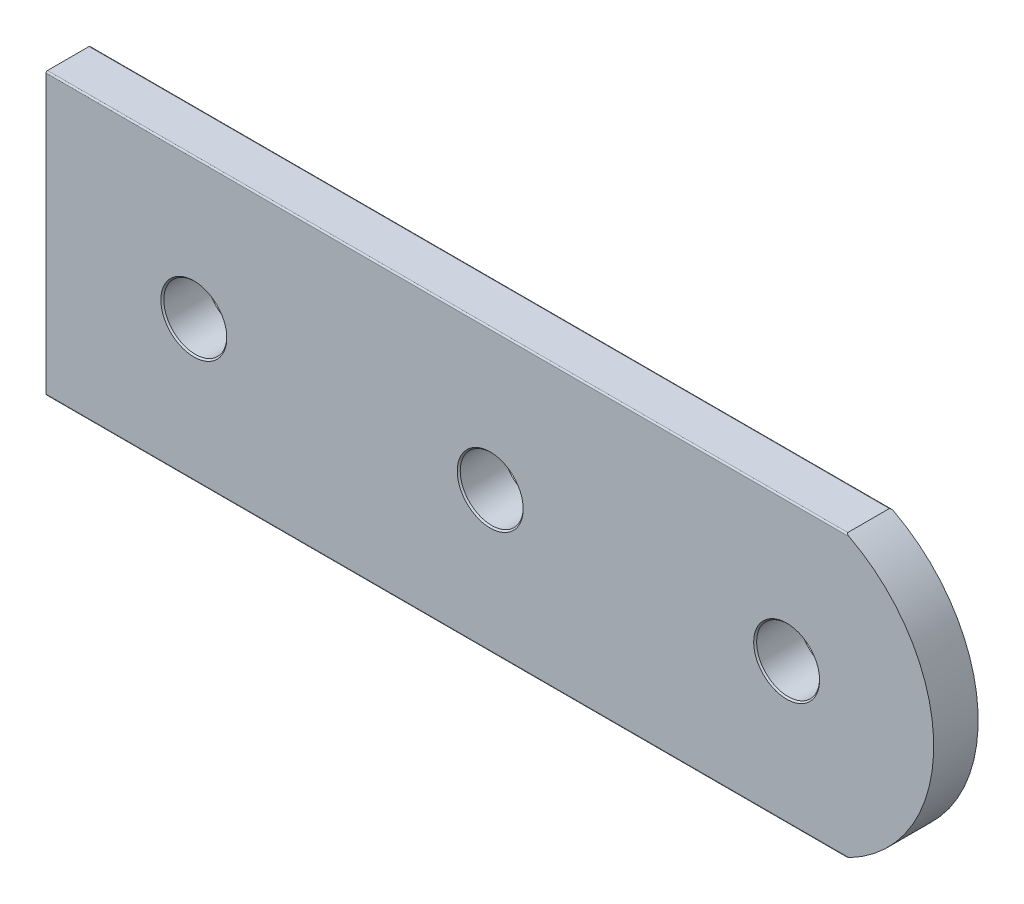
ISO-10303-21;
HEADER;
FILE_DESCRIPTION(('STEP AP214'),'2;1');
FILE_NAME('part.step','',(''),(''),'','','');
FILE_SCHEMA(('AUTOMOTIVE_DESIGN { 1 0 10303 214 1 1 1 1 }'));
ENDSEC;
DATA;
#1=APPLICATION_CONTEXT('core data for automotive mechanical design processes');
#2=APPLICATION_PROTOCOL_DEFINITION('international standard','automotive_design',2000,#1);
#3=PRODUCT_CONTEXT('',#1,'mechanical');
#4=PRODUCT('Part','Part','',(#3));
#5=PRODUCT_RELATED_PRODUCT_CATEGORY('part','',(#4));
#6=PRODUCT_DEFINITION_FORMATION('','',#4);
#7=PRODUCT_DEFINITION_CONTEXT('part definition',#1,'design');
#8=PRODUCT_DEFINITION('design','',#6,#7);
#9=PRODUCT_DEFINITION_SHAPE('','',#8);
#10=(LENGTH_UNIT() NAMED_UNIT(*) SI_UNIT(.MILLI.,.METRE.));
#11=(NAMED_UNIT(*) PLANE_ANGLE_UNIT() SI_UNIT($,.RADIAN.));
#12=(NAMED_UNIT(*) SI_UNIT($,.STERADIAN.) SOLID_ANGLE_UNIT());
#13=UNCERTAINTY_MEASURE_WITH_UNIT(LENGTH_MEASURE(1.E-05),#10,'distance_accuracy_value','');
#14=(GEOMETRIC_REPRESENTATION_CONTEXT(3) GLOBAL_UNCERTAINTY_ASSIGNED_CONTEXT((#13)) GLOBAL_UNIT_ASSIGNED_CONTEXT((#10,
#11,#12)) REPRESENTATION_CONTEXT('',''));
#15=CARTESIAN_POINT('',(0.,0.,0.));
#16=DIRECTION('',(0.,0.,1.));
#17=DIRECTION('',(1.,0.,0.));
#18=AXIS2_PLACEMENT_3D('',#15,#16,#17);
#19=CARTESIAN_POINT('',(44.6837923728814,0.,6.));
#20=DIRECTION('',(0.,0.,-1.));
#21=DIRECTION('',(-1.,0.,0.));
#22=AXIS2_PLACEMENT_3D('',#19,#20,#21);
#23=PLANE('',#22);
#24=CARTESIAN_POINT('',(45.95,0.,6.));
#25=DIRECTION('',(0.,0.,-1.));
#26=DIRECTION('',(-1.,0.,0.));
#27=AXIS2_PLACEMENT_3D('',#24,#25,#26);
#28=CIRCLE('',#27,4.44999999999998);
#29=CARTESIAN_POINT('',(41.5,0.,6.));
#30=VERTEX_POINT('',#29);
#31=EDGE_CURVE('E236',#30,#30,#28,.T.);
#32=ORIENTED_EDGE('',*,*,#31,.T.);
#33=EDGE_LOOP('',(#32));
#34=FACE_BOUND('',#33,.T.);
#35=CARTESIAN_POINT('',(5.95,0.,6.));
#36=DIRECTION('',(0.,0.,-1.));
#37=DIRECTION('',(-1.,0.,0.));
#38=AXIS2_PLACEMENT_3D('',#35,#36,#37);
#39=CIRCLE('',#38,4.44999999999998);
#40=CARTESIAN_POINT('',(1.50000000000002,0.,6.));
#41=VERTEX_POINT('',#40);
#42=EDGE_CURVE('E233',#41,#41,#39,.T.);
#43=ORIENTED_EDGE('',*,*,#42,.T.);
#44=EDGE_LOOP('',(#43));
#45=FACE_BOUND('',#44,.T.);
#46=CARTESIAN_POINT('',(-34.05,0.,6.));
#47=DIRECTION('',(0.,0.,-1.));
#48=DIRECTION('',(-1.,0.,0.));
#49=AXIS2_PLACEMENT_3D('',#46,#47,#48);
#50=CIRCLE('',#49,4.44999999999998);
#51=CARTESIAN_POINT('',(-38.5,0.,6.));
#52=VERTEX_POINT('',#51);
#53=EDGE_CURVE('E230',#52,#52,#50,.T.);
#54=ORIENTED_EDGE('',*,*,#53,.T.);
#55=EDGE_LOOP('',(#54));
#56=FACE_BOUND('',#55,.T.);
#57=DIRECTION('',(0.,-1.,0.));
#58=VECTOR('',#57,1.);
#59=CARTESIAN_POINT('',(-54.,18.95,6.));
#60=LINE('',#59,#58);
#61=CARTESIAN_POINT('',(-54.,18.75,6.));
#62=VERTEX_POINT('',#61);
#63=CARTESIAN_POINT('',(-54.,-18.75,6.));
#64=VERTEX_POINT('',#63);
#65=EDGE_CURVE('E105',#62,#64,#60,.T.);
#66=ORIENTED_EDGE('',*,*,#65,.T.);
#67=DIRECTION('',(1.,0.,0.));
#68=VECTOR('',#67,1.);
#69=CARTESIAN_POINT('',(44.6837923728814,-18.75,6.));
#70=LINE('',#69,#68);
#71=CARTESIAN_POINT('',(54.3962444088805,-18.75,6.));
#72=VERTEX_POINT('',#71);
#73=EDGE_CURVE('E203',#64,#72,#70,.T.);
#74=ORIENTED_EDGE('',*,*,#73,.T.);
#75=CARTESIAN_POINT('',(44.6837923728814,0.,6.));
#76=DIRECTION('',(0.,0.,1.));
#77=DIRECTION('',(-1.,0.,0.));
#78=AXIS2_PLACEMENT_3D('',#75,#76,#77);
#79=CIRCLE('',#78,21.1162076271186);
#80=CARTESIAN_POINT('',(54.3962444088805,18.75,6.));
#81=VERTEX_POINT('',#80);
#82=EDGE_CURVE('E88',#72,#81,#79,.T.);
#83=ORIENTED_EDGE('',*,*,#82,.T.);
#84=DIRECTION('',(-1.,0.,0.));
#85=VECTOR('',#84,1.);
#86=CARTESIAN_POINT('',(44.6837923728814,18.75,6.));
#87=LINE('',#86,#85);
#88=EDGE_CURVE('E200',#81,#62,#87,.T.);
#89=ORIENTED_EDGE('',*,*,#88,.T.);
#90=EDGE_LOOP('',(#66,#74,#83,#89));
#91=FACE_BOUND('',#90,.T.);
#92=ADVANCED_FACE('F16',(#34,#45,#56,#91),#23,.F.);
#93=CARTESIAN_POINT('',(44.6837923728814,0.,0.));
#94=DIRECTION('',(0.,0.,-1.));
#95=DIRECTION('',(-1.,0.,0.));
#96=AXIS2_PLACEMENT_3D('',#93,#94,#95);
#97=PLANE('',#96);
#98=CARTESIAN_POINT('',(5.95,0.,0.));
#99=DIRECTION('',(0.,0.,1.));
#100=DIRECTION('',(1.,0.,0.));
#101=AXIS2_PLACEMENT_3D('',#98,#99,#100);
#102=CIRCLE('',#101,4.25);
#103=CARTESIAN_POINT('',(10.2,0.,0.));
#104=VERTEX_POINT('',#103);
#105=EDGE_CURVE('E276',#104,#104,#102,.T.);
#106=ORIENTED_EDGE('',*,*,#105,.T.);
#107=EDGE_LOOP('',(#106));
#108=FACE_BOUND('',#107,.T.);
#109=CARTESIAN_POINT('',(44.6837923728814,0.,0.));
#110=DIRECTION('',(0.,0.,1.));
#111=DIRECTION('',(-1.,0.,0.));
#112=AXIS2_PLACEMENT_3D('',#109,#110,#111);
#113=CIRCLE('',#112,21.1162076271186);
#114=CARTESIAN_POINT('',(54.3962444088805,-18.75,0.));
#115=VERTEX_POINT('',#114);
#116=CARTESIAN_POINT('',(54.3962444088805,18.75,0.));
#117=VERTEX_POINT('',#116);
#118=EDGE_CURVE('E195',#115,#117,#113,.T.);
#119=ORIENTED_EDGE('',*,*,#118,.F.);
#120=DIRECTION('',(1.,0.,0.));
#121=VECTOR('',#120,1.);
#122=CARTESIAN_POINT('',(-54.,-18.75,0.));
#123=LINE('',#122,#121);
#124=CARTESIAN_POINT('',(-54.,-18.75,0.));
#125=VERTEX_POINT('',#124);
#126=EDGE_CURVE('E199',#115,#125,#123,.F.);
#127=ORIENTED_EDGE('',*,*,#126,.T.);
#128=DIRECTION('',(0.,-1.,0.));
#129=VECTOR('',#128,1.);
#130=CARTESIAN_POINT('',(-54.,18.95,0.));
#131=LINE('',#130,#129);
#132=CARTESIAN_POINT('',(-54.,18.75,0.));
#133=VERTEX_POINT('',#132);
#134=EDGE_CURVE('E191',#133,#125,#131,.T.);
#135=ORIENTED_EDGE('',*,*,#134,.F.);
#136=DIRECTION('',(-1.,0.,0.));
#137=VECTOR('',#136,1.);
#138=CARTESIAN_POINT('',(54.,18.75,0.));
#139=LINE('',#138,#137);
#140=EDGE_CURVE('E389',#133,#117,#139,.F.);
#141=ORIENTED_EDGE('',*,*,#140,.T.);
#142=EDGE_LOOP('',(#119,#127,#135,#141));
#143=FACE_BOUND('',#142,.T.);
#144=CARTESIAN_POINT('',(-34.05,0.,0.));
#145=DIRECTION('',(0.,0.,1.));
#146=DIRECTION('',(1.,0.,0.));
#147=AXIS2_PLACEMENT_3D('',#144,#145,#146);
#148=CIRCLE('',#147,4.25);
#149=CARTESIAN_POINT('',(-29.8,0.,0.));
#150=VERTEX_POINT('',#149);
#151=EDGE_CURVE('E224',#150,#150,#148,.T.);
#152=ORIENTED_EDGE('',*,*,#151,.T.);
#153=EDGE_LOOP('',(#152));
#154=FACE_BOUND('',#153,.T.);
#155=CARTESIAN_POINT('',(45.95,0.,0.));
#156=DIRECTION('',(0.,0.,1.));
#157=DIRECTION('',(1.,0.,0.));
#158=AXIS2_PLACEMENT_3D('',#155,#156,#157);
#159=CIRCLE('',#158,4.25000000000001);
#160=CARTESIAN_POINT('',(50.2,0.,0.));
#161=VERTEX_POINT('',#160);
#162=EDGE_CURVE('E278',#161,#161,#159,.T.);
#163=ORIENTED_EDGE('',*,*,#162,.T.);
#164=EDGE_LOOP('',(#163));
#165=FACE_BOUND('',#164,.T.);
#166=ADVANCED_FACE('F134',(#108,#143,#154,#165),#97,.T.);
#167=CARTESIAN_POINT('',(44.6837923728814,0.,6.));
#168=DIRECTION('',(0.,0.,-1.));
#169=DIRECTION('',(-1.,0.,0.));
#170=AXIS2_PLACEMENT_3D('',#167,#168,#169);
#171=CYLINDRICAL_SURFACE('',#170,21.1162076271186);
#172=DIRECTION('',(0.,0.,-1.));
#173=VECTOR('',#172,1.);
#174=CARTESIAN_POINT('',(54.,-18.95,6.));
#175=LINE('',#174,#173);
#176=CARTESIAN_POINT('',(54.,-18.95,5.8));
#177=VERTEX_POINT('',#176);
#178=CARTESIAN_POINT('',(54.,-18.95,0.2));
#179=VERTEX_POINT('',#178);
#180=EDGE_CURVE('E86',#177,#179,#175,.T.);
#181=ORIENTED_EDGE('',*,*,#180,.T.);
#182=CARTESIAN_POINT('',(54.,-18.95,0.2));
#183=CARTESIAN_POINT('',(53.9999868194165,-18.9500064154001,0.194550465926362));
#184=CARTESIAN_POINT('',(54.0004523980503,-18.9497775947544,0.1891202648655));
#185=CARTESIAN_POINT('',(54.002218564497,-18.9489091884407,0.178493485046812));
#186=CARTESIAN_POINT('',(54.0035094074447,-18.9482743965238,0.173294927453223));
#187=CARTESIAN_POINT('',(54.0072149722096,-18.9464513956655,0.161949611102968));
#188=CARTESIAN_POINT('',(54.0098282338436,-18.9451653712981,0.155884792263301));
#189=CARTESIAN_POINT('',(54.0158974489973,-18.9421765120102,0.144284014392699));
#190=CARTESIAN_POINT('',(54.0193574554472,-18.9404716722816,0.138750782662168));
#191=CARTESIAN_POINT('',(54.0291756170008,-18.9356299465008,0.125016289202737));
#192=CARTESIAN_POINT('',(54.0360139738958,-18.9322539812266,0.117247063220694));
#193=CARTESIAN_POINT('',(54.0506137449004,-18.9250349917786,0.102906920243602));
#194=CARTESIAN_POINT('',(54.0583770150879,-18.9211910280947,0.0963384821919904));
#195=CARTESIAN_POINT('',(54.0823275852944,-18.9093117750044,0.0782284223863727));
#196=CARTESIAN_POINT('',(54.0993464592125,-18.9008450443247,0.0680842808155181));
#197=CARTESIAN_POINT('',(54.134457202031,-18.883314098321,0.0503956235499217));
#198=CARTESIAN_POINT('',(54.1525550571771,-18.8742465109768,0.0428675771749012));
#199=CARTESIAN_POINT('',(54.1894005447429,-18.8557170302835,0.0298454376644634));
#200=CARTESIAN_POINT('',(54.2081511683779,-18.846253265469,0.0243625947042368));
#201=CARTESIAN_POINT('',(54.2459805007138,-18.8270877697148,0.0151476204931579));
#202=CARTESIAN_POINT('',(54.2650596250004,-18.8173857295261,0.0114179063197042));
#203=CARTESIAN_POINT('',(54.302829205083,-18.7981060483122,0.00561770901164146));
#204=CARTESIAN_POINT('',(54.3215151849108,-18.7885327767274,0.00350285160321799));
#205=CARTESIAN_POINT('',(54.3588884668333,-18.7693149265254,0.0007021848060779));
#206=CARTESIAN_POINT('',(54.3775756032493,-18.7596706406163,1.21887682535689E-05));
#207=CARTESIAN_POINT('',(54.3962444088805,-18.75,0.));
#208=B_SPLINE_CURVE_WITH_KNOTS('',3,(#182,#183,#184,#185,#186,#187,#188,#189,#190,#191,#192,
#193,#194,#195,#196,#197,#198,#199,#200,#201,#202,#203,#204,#205,#206,#207),.UNSPECIFIED.,.F.,
.F.,(4,2,2,2,2,2,2,2,2,2,2,2,4),(0.,0.0162927440022278,0.0323965670950297,0.0524679416772241,
0.072637334006888,0.105113110783549,0.13765519255256,0.201934992543515,0.266612423892925,
0.331640559833316,0.396758090413792,0.460014564562819,0.523084907144272),.UNSPECIFIED.);
#209=EDGE_CURVE('E93',#179,#115,#208,.T.);
#210=ORIENTED_EDGE('',*,*,#209,.T.);
#211=ORIENTED_EDGE('',*,*,#118,.T.);
#212=CARTESIAN_POINT('',(54.3962444088805,18.75,0.));
#213=CARTESIAN_POINT('',(54.3742934599988,18.7613710536704,2.44290690175026E-05));
#214=CARTESIAN_POINT('',(54.3523113640033,18.7727083345461,0.000971873816157577));
#215=CARTESIAN_POINT('',(54.3083006485108,18.7953099396118,0.00485360038309001));
#216=CARTESIAN_POINT('',(54.2862726993856,18.8065732703231,0.00780111403305795));
#217=CARTESIAN_POINT('',(54.2422326500104,18.8289952778379,0.0158729982299389));
#218=CARTESIAN_POINT('',(54.2202236281851,18.8401512734075,0.0210219439677252));
#219=CARTESIAN_POINT('',(54.1768035200585,18.8620664343535,0.0338577991806164));
#220=CARTESIAN_POINT('',(54.1553907775336,18.8728267327313,0.041536712678745));
#221=CARTESIAN_POINT('',(54.1249031577676,18.8880853770681,0.0551767563441687));
#222=CARTESIAN_POINT('',(54.1153785843568,18.8928429750049,0.0598453836727995));
#223=CARTESIAN_POINT('',(54.0966777810217,18.90216711341,0.0700267800417852));
#224=CARTESIAN_POINT('',(54.0875017245081,18.9067335588793,0.0755399626130994));
#225=CARTESIAN_POINT('',(54.0696125800087,18.9156206403845,0.087631457836474));
#226=CARTESIAN_POINT('',(54.0609039600095,18.9199389251691,0.0942182205172756));
#227=CARTESIAN_POINT('',(54.0443753369033,18.9281218061316,0.108668290422764));
#228=CARTESIAN_POINT('',(54.0365527245204,18.9319877356623,0.116527674411202));
#229=CARTESIAN_POINT('',(54.0256191134481,18.9373841053858,0.129906466120613));
#230=CARTESIAN_POINT('',(54.0219757451044,18.9391808095276,0.134879680562326));
#231=CARTESIAN_POINT('',(54.0153154773904,18.9424632714776,0.145338034691141));
#232=CARTESIAN_POINT('',(54.0122988621209,18.9439488882755,0.150823404907579));
#233=CARTESIAN_POINT('',(54.0070794806891,18.9465181690715,0.162369432896502));
#234=CARTESIAN_POINT('',(54.0048894417567,18.9475955481412,0.168437413237071));
#235=CARTESIAN_POINT('',(54.0016528276821,18.9491874372709,0.180933871639558));
#236=CARTESIAN_POINT('',(54.0006012083516,18.9497044303411,0.187360625641638));
#237=CARTESIAN_POINT('',(54.0001293197973,18.9499364228423,0.194850797010645));
#238=CARTESIAN_POINT('',(54.0000808539869,18.9499602501278,0.195880112883014));
#239=CARTESIAN_POINT('',(54.000016272244,18.9499920004764,0.197939494656386));
#240=CARTESIAN_POINT('',(54.0000001402646,18.9499999314288,0.198969559931413));
#241=CARTESIAN_POINT('',(54.,18.95,0.199999999999999));
#242=B_SPLINE_CURVE_WITH_KNOTS('',3,(#212,#213,#214,#215,#216,#217,#218,#219,#220,#221,#222,
#223,#224,#225,#226,#227,#228,#229,#230,#231,#232,#233,#234,#235,#236,#237,#238,#239,#240,#241),
.UNSPECIFIED.,.F.,.F.,(4,2,2,2,2,2,2,2,2,2,2,2,2,2,4),(0.,0.0741668827758988,0.148829276810237,
0.224347850978816,0.29963000186123,0.334478814196152,0.369344744889702,0.404499677943938,
0.439548229510695,0.458768386245522,0.477997236368741,0.497511131276222,0.51693820423765,
0.520030153380512,0.523120567634354),.UNSPECIFIED.);
#243=CARTESIAN_POINT('',(54.,18.95,0.2));
#244=VERTEX_POINT('',#243);
#245=EDGE_CURVE('E94',#117,#244,#242,.T.);
#246=ORIENTED_EDGE('',*,*,#245,.T.);
#247=DIRECTION('',(0.,0.,-1.));
#248=VECTOR('',#247,1.);
#249=CARTESIAN_POINT('',(54.,18.95,6.));
#250=LINE('',#249,#248);
#251=CARTESIAN_POINT('',(54.,18.95,5.8));
#252=VERTEX_POINT('',#251);
#253=EDGE_CURVE('E211',#252,#244,#250,.T.);
#254=ORIENTED_EDGE('',*,*,#253,.F.);
#255=CARTESIAN_POINT('',(54.,18.95,5.8));
#256=CARTESIAN_POINT('',(53.9999868194165,18.9500064154001,5.80544953407364));
#257=CARTESIAN_POINT('',(54.0004523980503,18.9497775947544,5.8108797351345));
#258=CARTESIAN_POINT('',(54.002218564497,18.9489091884407,5.82150651495319));
#259=CARTESIAN_POINT('',(54.0035094074447,18.9482743965238,5.82670507254678));
#260=CARTESIAN_POINT('',(54.0072149722096,18.9464513956655,5.83805038889703));
#261=CARTESIAN_POINT('',(54.0098282338436,18.9451653712981,5.8441152077367));
#262=CARTESIAN_POINT('',(54.0158974489973,18.9421765120102,5.8557159856073));
#263=CARTESIAN_POINT('',(54.0193574554472,18.9404716722816,5.86124921733783));
#264=CARTESIAN_POINT('',(54.0291756170008,18.9356299465008,5.87498371079726));
#265=CARTESIAN_POINT('',(54.0360139738958,18.9322539812266,5.88275293677931));
#266=CARTESIAN_POINT('',(54.0506137449004,18.9250349917786,5.8970930797564));
#267=CARTESIAN_POINT('',(54.0583770150879,18.9211910280947,5.90366151780801));
#268=CARTESIAN_POINT('',(54.0823275852944,18.9093117750044,5.92177157761363));
#269=CARTESIAN_POINT('',(54.0993464592125,18.9008450443247,5.93191571918448));
#270=CARTESIAN_POINT('',(54.134457202031,18.883314098321,5.94960437645008));
#271=CARTESIAN_POINT('',(54.1525550571771,18.8742465109768,5.9571324228251));
#272=CARTESIAN_POINT('',(54.1894005447429,18.8557170302835,5.97015456233554));
#273=CARTESIAN_POINT('',(54.2081511683779,18.846253265469,5.97563740529576));
#274=CARTESIAN_POINT('',(54.2459805007138,18.8270877697148,5.98485237950684));
#275=CARTESIAN_POINT('',(54.2650596250004,18.8173857295261,5.9885820936803));
#276=CARTESIAN_POINT('',(54.302829205083,18.7981060483122,5.99438229098836));
#277=CARTESIAN_POINT('',(54.3215151849108,18.7885327767274,5.99649714839678));
#278=CARTESIAN_POINT('',(54.3588884668333,18.7693149265254,5.99929781519392));
#279=CARTESIAN_POINT('',(54.3775756032493,18.7596706406163,5.99998781123175));
#280=CARTESIAN_POINT('',(54.3962444088805,18.75,6.));
#281=B_SPLINE_CURVE_WITH_KNOTS('',3,(#255,#256,#257,#258,#259,#260,#261,#262,#263,#264,#265,
#266,#267,#268,#269,#270,#271,#272,#273,#274,#275,#276,#277,#278,#279,#280),.UNSPECIFIED.,.F.,
.F.,(4,2,2,2,2,2,2,2,2,2,2,2,4),(0.,0.0162927440022287,0.0323965670950287,0.0524679416772245,
0.0726373340068922,0.105113110783549,0.137655192552565,0.201934992543522,0.266612423892938,
0.331640559833321,0.396758090413797,0.460014564562824,0.523084907144277),.UNSPECIFIED.);
#282=EDGE_CURVE('E112',#252,#81,#281,.T.);
#283=ORIENTED_EDGE('',*,*,#282,.T.);
#284=ORIENTED_EDGE('',*,*,#82,.F.);
#285=CARTESIAN_POINT('',(54.3962444088805,-18.75,6.));
#286=CARTESIAN_POINT('',(54.3742934599988,-18.7613710536704,5.99997557093098));
#287=CARTESIAN_POINT('',(54.3523113640033,-18.7727083345461,5.99902812618384));
#288=CARTESIAN_POINT('',(54.3083006485108,-18.7953099396118,5.99514639961691));
#289=CARTESIAN_POINT('',(54.2862726993856,-18.8065732703231,5.99219888596694));
#290=CARTESIAN_POINT('',(54.2422326500104,-18.8289952778379,5.98412700177006));
#291=CARTESIAN_POINT('',(54.2202236281851,-18.8401512734075,5.97897805603227));
#292=CARTESIAN_POINT('',(54.1768035200585,-18.8620664343535,5.96614220081938));
#293=CARTESIAN_POINT('',(54.1553907775337,-18.8728267327313,5.95846328732125));
#294=CARTESIAN_POINT('',(54.1249031577676,-18.8880853770681,5.94482324365583));
#295=CARTESIAN_POINT('',(54.1153785843568,-18.8928429750049,5.9401546163272));
#296=CARTESIAN_POINT('',(54.0966777810217,-18.90216711341,5.92997321995821));
#297=CARTESIAN_POINT('',(54.0875017245081,-18.9067335588793,5.9244600373869));
#298=CARTESIAN_POINT('',(54.0696125800087,-18.9156206403845,5.91236854216352));
#299=CARTESIAN_POINT('',(54.0609039600095,-18.9199389251691,5.90578177948272));
#300=CARTESIAN_POINT('',(54.0443753369033,-18.9281218061316,5.89133170957723));
#301=CARTESIAN_POINT('',(54.0365527245204,-18.9319877356623,5.88347232558879));
#302=CARTESIAN_POINT('',(54.0256191134481,-18.9373841053858,5.87009353387938));
#303=CARTESIAN_POINT('',(54.0219757451044,-18.9391808095276,5.86512031943767));
#304=CARTESIAN_POINT('',(54.0153154773904,-18.9424632714776,5.85466196530885));
#305=CARTESIAN_POINT('',(54.0122988621209,-18.9439488882755,5.84917659509242));
#306=CARTESIAN_POINT('',(54.0070794806891,-18.9465181690715,5.8376305671035));
#307=CARTESIAN_POINT('',(54.0048894417567,-18.9475955481412,5.83156258676293));
#308=CARTESIAN_POINT('',(54.0016528276821,-18.9491874372709,5.81906612836044));
#309=CARTESIAN_POINT('',(54.0006012083516,-18.9497044303411,5.81263937435836));
#310=CARTESIAN_POINT('',(54.0001293197973,-18.9499364228423,5.80514920298935));
#311=CARTESIAN_POINT('',(54.0000808539869,-18.9499602501278,5.80411988711699));
#312=CARTESIAN_POINT('',(54.000016272244,-18.9499920004764,5.80206050534361));
#313=CARTESIAN_POINT('',(54.0000001402646,-18.9499999314288,5.80103044006859));
#314=CARTESIAN_POINT('',(54.,-18.95,5.8));
#315=B_SPLINE_CURVE_WITH_KNOTS('',3,(#285,#286,#287,#288,#289,#290,#291,#292,#293,#294,#295,
#296,#297,#298,#299,#300,#301,#302,#303,#304,#305,#306,#307,#308,#309,#310,#311,#312,#313,#314),
.UNSPECIFIED.,.F.,.F.,(4,2,2,2,2,2,2,2,2,2,2,2,2,2,4),(0.,0.0741668827758988,0.148829276810237,
0.224347850978816,0.29963000186123,0.334478814196151,0.369344744889702,0.404499677943952,
0.439548229510696,0.458768386245533,0.477997236368743,0.497511131276227,0.516938204237651,
0.520030153380513,0.523120567634355),.UNSPECIFIED.);
#316=EDGE_CURVE('E83',#72,#177,#315,.T.);
#317=ORIENTED_EDGE('',*,*,#316,.T.);
#318=EDGE_LOOP('',(#181,#210,#211,#246,#254,#283,#284,#317));
#319=FACE_BOUND('',#318,.T.);
#320=ADVANCED_FACE('F85',(#319),#171,.T.);
#321=CARTESIAN_POINT('',(-54.,18.95,6.));
#322=DIRECTION('',(0.,-1.,0.));
#323=DIRECTION('',(1.,0.,0.));
#324=AXIS2_PLACEMENT_3D('',#321,#322,#323);
#325=PLANE('',#324);
#326=ORIENTED_EDGE('',*,*,#253,.T.);
#327=DIRECTION('',(-1.,0.,0.));
#328=VECTOR('',#327,1.);
#329=CARTESIAN_POINT('',(-54.,18.95,0.2));
#330=LINE('',#329,#328);
#331=CARTESIAN_POINT('',(-54.,18.95,0.2));
#332=VERTEX_POINT('',#331);
#333=EDGE_CURVE('E10',#244,#332,#330,.T.);
#334=ORIENTED_EDGE('',*,*,#333,.T.);
#335=DIRECTION('',(0.,0.,-1.));
#336=VECTOR('',#335,1.);
#337=CARTESIAN_POINT('',(-54.,18.95,6.));
#338=LINE('',#337,#336);
#339=CARTESIAN_POINT('',(-54.,18.95,5.8));
#340=VERTEX_POINT('',#339);
#341=EDGE_CURVE('E212',#340,#332,#338,.T.);
#342=ORIENTED_EDGE('',*,*,#341,.F.);
#343=DIRECTION('',(-1.,0.,0.));
#344=VECTOR('',#343,1.);
#345=CARTESIAN_POINT('',(-54.,18.95,5.8));
#346=LINE('',#345,#344);
#347=EDGE_CURVE('E25',#340,#252,#346,.F.);
#348=ORIENTED_EDGE('',*,*,#347,.T.);
#349=EDGE_LOOP('',(#326,#334,#342,#348));
#350=FACE_BOUND('',#349,.T.);
#351=ADVANCED_FACE('F133',(#350),#325,.F.);
#352=CARTESIAN_POINT('',(-54.,18.95,6.));
#353=DIRECTION('',(1.,0.,0.));
#354=DIRECTION('',(0.,1.,0.));
#355=AXIS2_PLACEMENT_3D('',#352,#353,#354);
#356=PLANE('',#355);
#357=ORIENTED_EDGE('',*,*,#134,.T.);
#358=CARTESIAN_POINT('',(-54.,-18.75,0.2));
#359=DIRECTION('',(1.,0.,0.));
#360=DIRECTION('',(0.,1.,0.));
#361=AXIS2_PLACEMENT_3D('',#358,#359,#360);
#362=CIRCLE('',#361,0.2);
#363=CARTESIAN_POINT('',(-54.,-18.95,0.2));
#364=VERTEX_POINT('',#363);
#365=EDGE_CURVE('E193',#125,#364,#362,.F.);
#366=ORIENTED_EDGE('',*,*,#365,.T.);
#367=DIRECTION('',(0.,0.,-1.));
#368=VECTOR('',#367,1.);
#369=CARTESIAN_POINT('',(-54.,-18.95,6.));
#370=LINE('',#369,#368);
#371=CARTESIAN_POINT('',(-54.,-18.95,5.8));
#372=VERTEX_POINT('',#371);
#373=EDGE_CURVE('E104',#372,#364,#370,.T.);
#374=ORIENTED_EDGE('',*,*,#373,.F.);
#375=CARTESIAN_POINT('',(-54.,-18.75,5.8));
#376=DIRECTION('',(1.,0.,0.));
#377=DIRECTION('',(0.,1.,0.));
#378=AXIS2_PLACEMENT_3D('',#375,#376,#377);
#379=CIRCLE('',#378,0.2);
#380=EDGE_CURVE('E109',#372,#64,#379,.F.);
#381=ORIENTED_EDGE('',*,*,#380,.T.);
#382=ORIENTED_EDGE('',*,*,#65,.F.);
#383=CARTESIAN_POINT('',(-54.,18.75,5.8));
#384=DIRECTION('',(1.,0.,0.));
#385=DIRECTION('',(0.,1.,0.));
#386=AXIS2_PLACEMENT_3D('',#383,#384,#385);
#387=CIRCLE('',#386,0.2);
#388=EDGE_CURVE('E39',#62,#340,#387,.F.);
#389=ORIENTED_EDGE('',*,*,#388,.T.);
#390=ORIENTED_EDGE('',*,*,#341,.T.);
#391=CARTESIAN_POINT('',(-54.,18.75,0.2));
#392=DIRECTION('',(1.,0.,0.));
#393=DIRECTION('',(0.,1.,0.));
#394=AXIS2_PLACEMENT_3D('',#391,#392,#393);
#395=CIRCLE('',#394,0.2);
#396=EDGE_CURVE('E32',#332,#133,#395,.F.);
#397=ORIENTED_EDGE('',*,*,#396,.T.);
#398=EDGE_LOOP('',(#357,#366,#374,#381,#382,#389,#390,#397));
#399=FACE_BOUND('',#398,.T.);
#400=ADVANCED_FACE('F183',(#399),#356,.F.);
#401=CARTESIAN_POINT('',(-54.,-18.95,6.));
#402=DIRECTION('',(0.,1.,0.));
#403=DIRECTION('',(-1.,0.,0.));
#404=AXIS2_PLACEMENT_3D('',#401,#402,#403);
#405=PLANE('',#404);
#406=ORIENTED_EDGE('',*,*,#373,.T.);
#407=DIRECTION('',(1.,0.,0.));
#408=VECTOR('',#407,1.);
#409=CARTESIAN_POINT('',(54.,-18.95,0.2));
#410=LINE('',#409,#408);
#411=EDGE_CURVE('E103',#364,#179,#410,.T.);
#412=ORIENTED_EDGE('',*,*,#411,.T.);
#413=ORIENTED_EDGE('',*,*,#180,.F.);
#414=DIRECTION('',(1.,0.,0.));
#415=VECTOR('',#414,1.);
#416=CARTESIAN_POINT('',(-54.,-18.95,5.8));
#417=LINE('',#416,#415);
#418=EDGE_CURVE('E100',#177,#372,#417,.F.);
#419=ORIENTED_EDGE('',*,*,#418,.T.);
#420=EDGE_LOOP('',(#406,#412,#413,#419));
#421=FACE_BOUND('',#420,.T.);
#422=ADVANCED_FACE('F99',(#421),#405,.F.);
#423=CARTESIAN_POINT('',(-34.05,0.,6.));
#424=DIRECTION('',(0.,0.,-1.));
#425=DIRECTION('',(-1.,0.,0.));
#426=AXIS2_PLACEMENT_3D('',#423,#424,#425);
#427=CYLINDRICAL_SURFACE('',#426,4.25);
#428=CARTESIAN_POINT('',(-34.05,0.,5.80000000000002));
#429=DIRECTION('',(0.,0.,-1.));
#430=DIRECTION('',(-1.,0.,0.));
#431=AXIS2_PLACEMENT_3D('',#428,#429,#430);
#432=CIRCLE('',#431,4.25);
#433=CARTESIAN_POINT('',(-38.3,0.,5.80000000000002));
#434=VERTEX_POINT('',#433);
#435=EDGE_CURVE('E110',#434,#434,#432,.F.);
#436=ORIENTED_EDGE('',*,*,#435,.T.);
#437=EDGE_LOOP('',(#436));
#438=FACE_BOUND('',#437,.T.);
#439=ORIENTED_EDGE('',*,*,#151,.F.);
#440=EDGE_LOOP('',(#439));
#441=FACE_BOUND('',#440,.T.);
#442=ADVANCED_FACE('F179',(#438,#441),#427,.F.);
#443=CARTESIAN_POINT('',(5.95,0.,6.));
#444=DIRECTION('',(0.,0.,-1.));
#445=DIRECTION('',(-1.,0.,0.));
#446=AXIS2_PLACEMENT_3D('',#443,#444,#445);
#447=CYLINDRICAL_SURFACE('',#446,4.25);
#448=CARTESIAN_POINT('',(5.95,0.,5.80000000000002));
#449=DIRECTION('',(0.,0.,-1.));
#450=DIRECTION('',(-1.,0.,0.));
#451=AXIS2_PLACEMENT_3D('',#448,#449,#450);
#452=CIRCLE('',#451,4.25);
#453=CARTESIAN_POINT('',(1.7,0.,5.80000000000002));
#454=VERTEX_POINT('',#453);
#455=EDGE_CURVE('E115',#454,#454,#452,.F.);
#456=ORIENTED_EDGE('',*,*,#455,.T.);
#457=EDGE_LOOP('',(#456));
#458=FACE_BOUND('',#457,.T.);
#459=ORIENTED_EDGE('',*,*,#105,.F.);
#460=EDGE_LOOP('',(#459));
#461=FACE_BOUND('',#460,.T.);
#462=ADVANCED_FACE('F240',(#458,#461),#447,.F.);
#463=CARTESIAN_POINT('',(45.95,0.,6.));
#464=DIRECTION('',(0.,0.,-1.));
#465=DIRECTION('',(-1.,0.,0.));
#466=AXIS2_PLACEMENT_3D('',#463,#464,#465);
#467=CYLINDRICAL_SURFACE('',#466,4.25000000000001);
#468=CARTESIAN_POINT('',(45.95,0.,5.80000000000003));
#469=DIRECTION('',(0.,0.,-1.));
#470=DIRECTION('',(-1.,0.,0.));
#471=AXIS2_PLACEMENT_3D('',#468,#469,#470);
#472=CIRCLE('',#471,4.25000000000001);
#473=CARTESIAN_POINT('',(41.7,0.,5.80000000000003));
#474=VERTEX_POINT('',#473);
#475=EDGE_CURVE('E215',#474,#474,#472,.F.);
#476=ORIENTED_EDGE('',*,*,#475,.T.);
#477=EDGE_LOOP('',(#476));
#478=FACE_BOUND('',#477,.T.);
#479=ORIENTED_EDGE('',*,*,#162,.F.);
#480=EDGE_LOOP('',(#479));
#481=FACE_BOUND('',#480,.T.);
#482=ADVANCED_FACE('F252',(#478,#481),#467,.F.);
#483=CARTESIAN_POINT('',(45.95,0.,5.80000000000003));
#484=DIRECTION('',(0.,0.,1.));
#485=DIRECTION('',(1.,0.,0.));
#486=AXIS2_PLACEMENT_3D('',#483,#484,#485);
#487=CONICAL_SURFACE('',#486,4.25000000000001,0.785398163397461);
#488=ORIENTED_EDGE('',*,*,#31,.F.);
#489=EDGE_LOOP('',(#488));
#490=FACE_BOUND('',#489,.T.);
#491=ORIENTED_EDGE('',*,*,#475,.F.);
#492=EDGE_LOOP('',(#491));
#493=FACE_BOUND('',#492,.T.);
#494=ADVANCED_FACE('F137',(#490,#493),#487,.F.);
#495=CARTESIAN_POINT('',(5.95,0.,5.80000000000002));
#496=DIRECTION('',(0.,0.,1.));
#497=DIRECTION('',(1.,0.,0.));
#498=AXIS2_PLACEMENT_3D('',#495,#496,#497);
#499=CONICAL_SURFACE('',#498,4.25,0.785398163397461);
#500=ORIENTED_EDGE('',*,*,#42,.F.);
#501=EDGE_LOOP('',(#500));
#502=FACE_BOUND('',#501,.T.);
#503=ORIENTED_EDGE('',*,*,#455,.F.);
#504=EDGE_LOOP('',(#503));
#505=FACE_BOUND('',#504,.T.);
#506=ADVANCED_FACE('F243',(#502,#505),#499,.F.);
#507=CARTESIAN_POINT('',(-34.05,0.,5.80000000000002));
#508=DIRECTION('',(0.,0.,1.));
#509=DIRECTION('',(1.,0.,0.));
#510=AXIS2_PLACEMENT_3D('',#507,#508,#509);
#511=CONICAL_SURFACE('',#510,4.25,0.785398163397461);
#512=ORIENTED_EDGE('',*,*,#53,.F.);
#513=EDGE_LOOP('',(#512));
#514=FACE_BOUND('',#513,.T.);
#515=ORIENTED_EDGE('',*,*,#435,.F.);
#516=EDGE_LOOP('',(#515));
#517=FACE_BOUND('',#516,.T.);
#518=ADVANCED_FACE('F245',(#514,#517),#511,.F.);
#519=CARTESIAN_POINT('',(-54.,-18.75,0.2));
#520=DIRECTION('',(-1.,0.,0.));
#521=DIRECTION('',(0.,-1.,0.));
#522=AXIS2_PLACEMENT_3D('',#519,#520,#521);
#523=CYLINDRICAL_SURFACE('',#522,0.2);
#524=ORIENTED_EDGE('',*,*,#365,.F.);
#525=ORIENTED_EDGE('',*,*,#126,.F.);
#526=ORIENTED_EDGE('',*,*,#209,.F.);
#527=ORIENTED_EDGE('',*,*,#411,.F.);
#528=EDGE_LOOP('',(#524,#525,#526,#527));
#529=FACE_BOUND('',#528,.T.);
#530=ADVANCED_FACE('F157',(#529),#523,.T.);
#531=CARTESIAN_POINT('',(44.6837923728814,-18.75,5.8));
#532=DIRECTION('',(1.,0.,0.));
#533=DIRECTION('',(0.,1.,0.));
#534=AXIS2_PLACEMENT_3D('',#531,#532,#533);
#535=CYLINDRICAL_SURFACE('',#534,0.2);
#536=ORIENTED_EDGE('',*,*,#380,.F.);
#537=ORIENTED_EDGE('',*,*,#418,.F.);
#538=ORIENTED_EDGE('',*,*,#316,.F.);
#539=ORIENTED_EDGE('',*,*,#73,.F.);
#540=EDGE_LOOP('',(#536,#537,#538,#539));
#541=FACE_BOUND('',#540,.T.);
#542=ADVANCED_FACE('F108',(#541),#535,.T.);
#543=CARTESIAN_POINT('',(-54.,18.75,0.2));
#544=DIRECTION('',(1.,0.,0.));
#545=DIRECTION('',(0.,1.,0.));
#546=AXIS2_PLACEMENT_3D('',#543,#544,#545);
#547=CYLINDRICAL_SURFACE('',#546,0.2);
#548=ORIENTED_EDGE('',*,*,#245,.F.);
#549=ORIENTED_EDGE('',*,*,#140,.F.);
#550=ORIENTED_EDGE('',*,*,#396,.F.);
#551=ORIENTED_EDGE('',*,*,#333,.F.);
#552=EDGE_LOOP('',(#548,#549,#550,#551));
#553=FACE_BOUND('',#552,.T.);
#554=ADVANCED_FACE('F156',(#553),#547,.T.);
#555=CARTESIAN_POINT('',(44.6837923728814,18.75,5.8));
#556=DIRECTION('',(-1.,0.,0.));
#557=DIRECTION('',(0.,-1.,0.));
#558=AXIS2_PLACEMENT_3D('',#555,#556,#557);
#559=CYLINDRICAL_SURFACE('',#558,0.2);
#560=ORIENTED_EDGE('',*,*,#282,.F.);
#561=ORIENTED_EDGE('',*,*,#347,.F.);
#562=ORIENTED_EDGE('',*,*,#388,.F.);
#563=ORIENTED_EDGE('',*,*,#88,.F.);
#564=EDGE_LOOP('',(#560,#561,#562,#563));
#565=FACE_BOUND('',#564,.T.);
#566=ADVANCED_FACE('F18',(#565),#559,.T.);
#567=CLOSED_SHELL('',(#92,#166,#320,#351,#400,#422,#442,#462,#482,#494,#506,#518,#530,#542,#554,#566));
#568=MANIFOLD_SOLID_BREP('B1',#567);
#569=ADVANCED_BREP_SHAPE_REPRESENTATION('',(#18,#568),#14);
#570=SHAPE_DEFINITION_REPRESENTATION(#9,#569);
ENDSEC;
END-ISO-10303-21;
